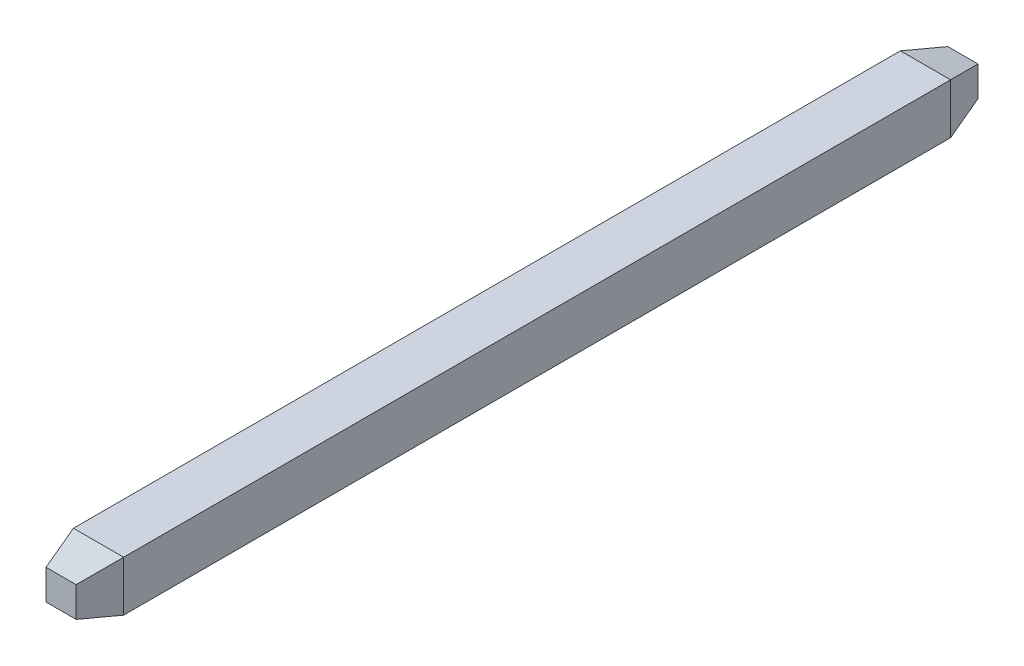
ISO-10303-21;
HEADER;
FILE_DESCRIPTION(('STEP AP214'),'2;1');
FILE_NAME('part.step','',(''),(''),'','','');
FILE_SCHEMA(('AUTOMOTIVE_DESIGN { 1 0 10303 214 1 1 1 1 }'));
ENDSEC;
DATA;
#1=APPLICATION_CONTEXT('core data for automotive mechanical design processes');
#2=APPLICATION_PROTOCOL_DEFINITION('international standard','automotive_design',2000,#1);
#3=PRODUCT_CONTEXT('',#1,'mechanical');
#4=PRODUCT('Part','Part','',(#3));
#5=PRODUCT_RELATED_PRODUCT_CATEGORY('part','',(#4));
#6=PRODUCT_DEFINITION_FORMATION('','',#4);
#7=PRODUCT_DEFINITION_CONTEXT('part definition',#1,'design');
#8=PRODUCT_DEFINITION('design','',#6,#7);
#9=PRODUCT_DEFINITION_SHAPE('','',#8);
#10=(LENGTH_UNIT() NAMED_UNIT(*) SI_UNIT(.MILLI.,.METRE.));
#11=(NAMED_UNIT(*) PLANE_ANGLE_UNIT() SI_UNIT($,.RADIAN.));
#12=(NAMED_UNIT(*) SI_UNIT($,.STERADIAN.) SOLID_ANGLE_UNIT());
#13=UNCERTAINTY_MEASURE_WITH_UNIT(LENGTH_MEASURE(1.E-05),#10,'distance_accuracy_value','');
#14=(GEOMETRIC_REPRESENTATION_CONTEXT(3) GLOBAL_UNCERTAINTY_ASSIGNED_CONTEXT((#13)) GLOBAL_UNIT_ASSIGNED_CONTEXT((#10,
#11,#12)) REPRESENTATION_CONTEXT('',''));
#15=CARTESIAN_POINT('',(0.,0.,0.));
#16=DIRECTION('',(0.,0.,1.));
#17=DIRECTION('',(1.,0.,0.));
#18=AXIS2_PLACEMENT_3D('',#15,#16,#17);
#19=CARTESIAN_POINT('',(6.08859499326237,-0.320000000000112,7.92229749663118));
#20=DIRECTION('',(0.,-0.965925826289069,0.25881904510252));
#21=DIRECTION('',(0.,-0.25881904510252,-0.965925826289069));
#22=AXIS2_PLACEMENT_3D('',#19,#20,#21);
#23=PLANE('',#22);
#24=DIRECTION('',(1.,0.,0.));
#25=VECTOR('',#24,1.);
#26=CARTESIAN_POINT('',(7.62,-0.192000000000112,8.4));
#27=LINE('',#26,#25);
#28=CARTESIAN_POINT('',(7.428,-0.192000000000111,8.4));
#29=VERTEX_POINT('',#28);
#30=CARTESIAN_POINT('',(7.812,-0.192000000000111,8.4));
#31=VERTEX_POINT('',#30);
#32=EDGE_CURVE('E20',#29,#31,#27,.T.);
#33=ORIENTED_EDGE('',*,*,#32,.F.);
#34=DIRECTION('',(0.250562807085731,0.25056280708573,0.93511312653103));
#35=VECTOR('',#34,1.);
#36=CARTESIAN_POINT('',(7.3,-0.320000000000112,7.92229749663118));
#37=LINE('',#36,#35);
#38=CARTESIAN_POINT('',(7.3,-0.320000000000112,7.92229749663118));
#39=VERTEX_POINT('',#38);
#40=EDGE_CURVE('E110',#39,#29,#37,.T.);
#41=ORIENTED_EDGE('',*,*,#40,.F.);
#42=DIRECTION('',(1.,0.,0.));
#43=VECTOR('',#42,1.);
#44=CARTESIAN_POINT('',(7.3,-0.320000000000112,7.92229749663118));
#45=LINE('',#44,#43);
#46=CARTESIAN_POINT('',(7.94,-0.320000000000111,7.92229749663118));
#47=VERTEX_POINT('',#46);
#48=EDGE_CURVE('E96',#47,#39,#45,.F.);
#49=ORIENTED_EDGE('',*,*,#48,.F.);
#50=DIRECTION('',(0.250562807085732,-0.25056280708573,-0.93511312653103));
#51=VECTOR('',#50,1.);
#52=CARTESIAN_POINT('',(7.812,-0.192000000000111,8.4));
#53=LINE('',#52,#51);
#54=EDGE_CURVE('E94',#31,#47,#53,.T.);
#55=ORIENTED_EDGE('',*,*,#54,.F.);
#56=EDGE_LOOP('',(#33,#41,#49,#55));
#57=FACE_BOUND('',#56,.T.);
#58=ADVANCED_FACE('F17',(#57),#23,.T.);
#59=CARTESIAN_POINT('',(6.08859499326237,-0.320000000000112,-2.62229749663118));
#60=DIRECTION('',(0.,0.965925826289068,0.258819045102521));
#61=DIRECTION('',(0.,-0.258819045102521,0.965925826289068));
#62=AXIS2_PLACEMENT_3D('',#59,#60,#61);
#63=PLANE('',#62);
#64=DIRECTION('',(0.250562807085733,0.25056280708573,-0.93511312653103));
#65=VECTOR('',#64,1.);
#66=CARTESIAN_POINT('',(7.3,-0.320000000000112,-2.62229749663118));
#67=LINE('',#66,#65);
#68=CARTESIAN_POINT('',(7.3,-0.320000000000112,-2.62229749663118));
#69=VERTEX_POINT('',#68);
#70=CARTESIAN_POINT('',(7.428,-0.192000000000111,-3.1));
#71=VERTEX_POINT('',#70);
#72=EDGE_CURVE('E113',#69,#71,#67,.T.);
#73=ORIENTED_EDGE('',*,*,#72,.T.);
#74=DIRECTION('',(1.,0.,0.));
#75=VECTOR('',#74,1.);
#76=CARTESIAN_POINT('',(7.62,-0.192000000000112,-3.1));
#77=LINE('',#76,#75);
#78=CARTESIAN_POINT('',(7.812,-0.192000000000111,-3.1));
#79=VERTEX_POINT('',#78);
#80=EDGE_CURVE('E79',#71,#79,#77,.T.);
#81=ORIENTED_EDGE('',*,*,#80,.T.);
#82=DIRECTION('',(0.250562807085734,-0.25056280708573,0.935113126531029));
#83=VECTOR('',#82,1.);
#84=CARTESIAN_POINT('',(7.812,-0.192000000000111,-3.1));
#85=LINE('',#84,#83);
#86=CARTESIAN_POINT('',(7.94,-0.320000000000111,-2.62229749663118));
#87=VERTEX_POINT('',#86);
#88=EDGE_CURVE('E108',#79,#87,#85,.T.);
#89=ORIENTED_EDGE('',*,*,#88,.T.);
#90=DIRECTION('',(1.,0.,0.));
#91=VECTOR('',#90,1.);
#92=CARTESIAN_POINT('',(7.3,-0.320000000000112,-2.62229749663118));
#93=LINE('',#92,#91);
#94=EDGE_CURVE('E118',#69,#87,#93,.T.);
#95=ORIENTED_EDGE('',*,*,#94,.F.);
#96=EDGE_LOOP('',(#73,#81,#89,#95));
#97=FACE_BOUND('',#96,.T.);
#98=ADVANCED_FACE('F281',(#97),#63,.F.);
#99=CARTESIAN_POINT('',(7.62,-1.12044153219634E-13,8.4));
#100=DIRECTION('',(0.,0.,1.));
#101=DIRECTION('',(1.,0.,0.));
#102=AXIS2_PLACEMENT_3D('',#99,#100,#101);
#103=PLANE('',#102);
#104=ORIENTED_EDGE('',*,*,#32,.T.);
#105=DIRECTION('',(0.,1.,0.));
#106=VECTOR('',#105,1.);
#107=CARTESIAN_POINT('',(7.812,-1.53140500673774,8.4));
#108=LINE('',#107,#106);
#109=CARTESIAN_POINT('',(7.812,0.191999999999889,8.4));
#110=VERTEX_POINT('',#109);
#111=EDGE_CURVE('E88',#110,#31,#108,.F.);
#112=ORIENTED_EDGE('',*,*,#111,.F.);
#113=DIRECTION('',(1.,0.,0.));
#114=VECTOR('',#113,1.);
#115=CARTESIAN_POINT('',(9.15140500673763,0.191999999999887,8.4));
#116=LINE('',#115,#114);
#117=CARTESIAN_POINT('',(7.428,0.191999999999888,8.4));
#118=VERTEX_POINT('',#117);
#119=EDGE_CURVE('E124',#118,#110,#116,.T.);
#120=ORIENTED_EDGE('',*,*,#119,.F.);
#121=DIRECTION('',(0.,1.,0.));
#122=VECTOR('',#121,1.);
#123=CARTESIAN_POINT('',(7.428,1.53140500673752,8.4));
#124=LINE('',#123,#122);
#125=EDGE_CURVE('E90',#29,#118,#124,.T.);
#126=ORIENTED_EDGE('',*,*,#125,.F.);
#127=EDGE_LOOP('',(#104,#112,#120,#126));
#128=FACE_BOUND('',#127,.T.);
#129=ADVANCED_FACE('F85',(#128),#103,.T.);
#130=CARTESIAN_POINT('',(7.94,-1.53140500673774,7.92229749663118));
#131=DIRECTION('',(0.965925826289069,0.,0.25881904510252));
#132=DIRECTION('',(0.25881904510252,0.,-0.965925826289069));
#133=AXIS2_PLACEMENT_3D('',#130,#131,#132);
#134=PLANE('',#133);
#135=ORIENTED_EDGE('',*,*,#111,.T.);
#136=ORIENTED_EDGE('',*,*,#54,.T.);
#137=DIRECTION('',(0.,1.,0.));
#138=VECTOR('',#137,1.);
#139=CARTESIAN_POINT('',(7.94,-0.320000000000111,7.92229749663118));
#140=LINE('',#139,#138);
#141=CARTESIAN_POINT('',(7.94,0.319999999999888,7.92229749663118));
#142=VERTEX_POINT('',#141);
#143=EDGE_CURVE('E127',#142,#47,#140,.F.);
#144=ORIENTED_EDGE('',*,*,#143,.F.);
#145=DIRECTION('',(0.25056280708573,0.250562807085731,-0.93511312653103));
#146=VECTOR('',#145,1.);
#147=CARTESIAN_POINT('',(7.812,0.191999999999888,8.4));
#148=LINE('',#147,#146);
#149=EDGE_CURVE('E102',#110,#142,#148,.T.);
#150=ORIENTED_EDGE('',*,*,#149,.F.);
#151=EDGE_LOOP('',(#135,#136,#144,#150));
#152=FACE_BOUND('',#151,.T.);
#153=ADVANCED_FACE('F100',(#152),#134,.T.);
#154=CARTESIAN_POINT('',(7.62,-1.12044153219634E-13,-3.1));
#155=DIRECTION('',(0.,0.,1.));
#156=DIRECTION('',(1.,0.,0.));
#157=AXIS2_PLACEMENT_3D('',#154,#155,#156);
#158=PLANE('',#157);
#159=DIRECTION('',(0.,1.,0.));
#160=VECTOR('',#159,1.);
#161=CARTESIAN_POINT('',(7.812,-1.53140500673774,-3.1));
#162=LINE('',#161,#160);
#163=CARTESIAN_POINT('',(7.812,0.191999999999889,-3.1));
#164=VERTEX_POINT('',#163);
#165=EDGE_CURVE('E106',#164,#79,#162,.F.);
#166=ORIENTED_EDGE('',*,*,#165,.T.);
#167=ORIENTED_EDGE('',*,*,#80,.F.);
#168=DIRECTION('',(0.,1.,0.));
#169=VECTOR('',#168,1.);
#170=CARTESIAN_POINT('',(7.428,1.53140500673752,-3.1));
#171=LINE('',#170,#169);
#172=CARTESIAN_POINT('',(7.428,0.191999999999888,-3.1));
#173=VERTEX_POINT('',#172);
#174=EDGE_CURVE('E115',#71,#173,#171,.T.);
#175=ORIENTED_EDGE('',*,*,#174,.T.);
#176=DIRECTION('',(1.,0.,0.));
#177=VECTOR('',#176,1.);
#178=CARTESIAN_POINT('',(9.15140500673763,0.191999999999887,-3.1));
#179=LINE('',#178,#177);
#180=EDGE_CURVE('E138',#173,#164,#179,.T.);
#181=ORIENTED_EDGE('',*,*,#180,.T.);
#182=EDGE_LOOP('',(#166,#167,#175,#181));
#183=FACE_BOUND('',#182,.T.);
#184=ADVANCED_FACE('F257',(#183),#158,.F.);
#185=CARTESIAN_POINT('',(7.94,-1.53140500673774,-2.62229749663118));
#186=DIRECTION('',(-0.965925826289068,0.,0.258819045102521));
#187=DIRECTION('',(0.258819045102521,0.,0.965925826289068));
#188=AXIS2_PLACEMENT_3D('',#185,#186,#187);
#189=PLANE('',#188);
#190=ORIENTED_EDGE('',*,*,#88,.F.);
#191=ORIENTED_EDGE('',*,*,#165,.F.);
#192=DIRECTION('',(0.250562807085731,0.250562807085732,0.935113126531029));
#193=VECTOR('',#192,1.);
#194=CARTESIAN_POINT('',(7.812,0.191999999999887,-3.1));
#195=LINE('',#194,#193);
#196=CARTESIAN_POINT('',(7.94,0.319999999999888,-2.62229749663118));
#197=VERTEX_POINT('',#196);
#198=EDGE_CURVE('E140',#164,#197,#195,.T.);
#199=ORIENTED_EDGE('',*,*,#198,.T.);
#200=DIRECTION('',(0.,1.,0.));
#201=VECTOR('',#200,1.);
#202=CARTESIAN_POINT('',(7.94,-0.320000000000111,-2.62229749663118));
#203=LINE('',#202,#201);
#204=EDGE_CURVE('E133',#87,#197,#203,.T.);
#205=ORIENTED_EDGE('',*,*,#204,.F.);
#206=EDGE_LOOP('',(#190,#191,#199,#205));
#207=FACE_BOUND('',#206,.T.);
#208=ADVANCED_FACE('F249',(#207),#189,.F.);
#209=CARTESIAN_POINT('',(7.3,1.53140500673752,7.92229749663118));
#210=DIRECTION('',(-0.965925826289069,0.,0.25881904510252));
#211=DIRECTION('',(0.25881904510252,0.,0.965925826289069));
#212=AXIS2_PLACEMENT_3D('',#209,#210,#211);
#213=PLANE('',#212);
#214=ORIENTED_EDGE('',*,*,#125,.T.);
#215=DIRECTION('',(0.250562807085729,-0.250562807085731,0.93511312653103));
#216=VECTOR('',#215,1.);
#217=CARTESIAN_POINT('',(7.3,0.319999999999889,7.92229749663118));
#218=LINE('',#217,#216);
#219=CARTESIAN_POINT('',(7.3,0.319999999999888,7.92229749663118));
#220=VERTEX_POINT('',#219);
#221=EDGE_CURVE('E121',#220,#118,#218,.T.);
#222=ORIENTED_EDGE('',*,*,#221,.F.);
#223=DIRECTION('',(0.,-1.,0.));
#224=VECTOR('',#223,1.);
#225=CARTESIAN_POINT('',(7.3,0.319999999999889,7.92229749663118));
#226=LINE('',#225,#224);
#227=EDGE_CURVE('E142',#39,#220,#226,.F.);
#228=ORIENTED_EDGE('',*,*,#227,.F.);
#229=ORIENTED_EDGE('',*,*,#40,.T.);
#230=EDGE_LOOP('',(#214,#222,#228,#229));
#231=FACE_BOUND('',#230,.T.);
#232=ADVANCED_FACE('F171',(#231),#213,.T.);
#233=CARTESIAN_POINT('',(7.3,1.53140500673752,-2.62229749663118));
#234=DIRECTION('',(0.965925826289068,0.,0.258819045102521));
#235=DIRECTION('',(0.258819045102521,0.,-0.965925826289068));
#236=AXIS2_PLACEMENT_3D('',#233,#234,#235);
#237=PLANE('',#236);
#238=DIRECTION('',(0.250562807085729,-0.250562807085732,-0.93511312653103));
#239=VECTOR('',#238,1.);
#240=CARTESIAN_POINT('',(7.3,0.319999999999889,-2.62229749663118));
#241=LINE('',#240,#239);
#242=CARTESIAN_POINT('',(7.3,0.319999999999889,-2.62229749663118));
#243=VERTEX_POINT('',#242);
#244=EDGE_CURVE('E136',#243,#173,#241,.T.);
#245=ORIENTED_EDGE('',*,*,#244,.T.);
#246=ORIENTED_EDGE('',*,*,#174,.F.);
#247=ORIENTED_EDGE('',*,*,#72,.F.);
#248=DIRECTION('',(0.,-1.,0.));
#249=VECTOR('',#248,1.);
#250=CARTESIAN_POINT('',(7.3,0.319999999999889,-2.62229749663118));
#251=LINE('',#250,#249);
#252=EDGE_CURVE('E35',#243,#69,#251,.T.);
#253=ORIENTED_EDGE('',*,*,#252,.F.);
#254=EDGE_LOOP('',(#245,#246,#247,#253));
#255=FACE_BOUND('',#254,.T.);
#256=ADVANCED_FACE('F188',(#255),#237,.F.);
#257=CARTESIAN_POINT('',(7.3,-0.320000000000112,-3.1));
#258=DIRECTION('',(0.,-1.,0.));
#259=DIRECTION('',(1.,0.,0.));
#260=AXIS2_PLACEMENT_3D('',#257,#258,#259);
#261=PLANE('',#260);
#262=ORIENTED_EDGE('',*,*,#94,.T.);
#263=DIRECTION('',(0.,0.,1.));
#264=VECTOR('',#263,1.);
#265=CARTESIAN_POINT('',(7.94,-0.320000000000111,-3.1));
#266=LINE('',#265,#264);
#267=EDGE_CURVE('E130',#47,#87,#266,.F.);
#268=ORIENTED_EDGE('',*,*,#267,.F.);
#269=ORIENTED_EDGE('',*,*,#48,.T.);
#270=DIRECTION('',(0.,0.,1.));
#271=VECTOR('',#270,1.);
#272=CARTESIAN_POINT('',(7.3,-0.320000000000112,-3.1));
#273=LINE('',#272,#271);
#274=EDGE_CURVE('E146',#69,#39,#273,.T.);
#275=ORIENTED_EDGE('',*,*,#274,.F.);
#276=EDGE_LOOP('',(#262,#268,#269,#275));
#277=FACE_BOUND('',#276,.T.);
#278=ADVANCED_FACE('F174',(#277),#261,.T.);
#279=CARTESIAN_POINT('',(9.15140500673763,0.319999999999888,7.92229749663118));
#280=DIRECTION('',(0.,0.965925826289069,0.25881904510252));
#281=DIRECTION('',(0.,-0.25881904510252,0.965925826289069));
#282=AXIS2_PLACEMENT_3D('',#279,#280,#281);
#283=PLANE('',#282);
#284=ORIENTED_EDGE('',*,*,#119,.T.);
#285=ORIENTED_EDGE('',*,*,#149,.T.);
#286=DIRECTION('',(-1.,0.,0.));
#287=VECTOR('',#286,1.);
#288=CARTESIAN_POINT('',(7.94,0.319999999999888,7.92229749663118));
#289=LINE('',#288,#287);
#290=EDGE_CURVE('E149',#220,#142,#289,.F.);
#291=ORIENTED_EDGE('',*,*,#290,.F.);
#292=ORIENTED_EDGE('',*,*,#221,.T.);
#293=EDGE_LOOP('',(#284,#285,#291,#292));
#294=FACE_BOUND('',#293,.T.);
#295=ADVANCED_FACE('F179',(#294),#283,.T.);
#296=CARTESIAN_POINT('',(7.94,-0.320000000000111,-3.1));
#297=DIRECTION('',(1.,0.,0.));
#298=DIRECTION('',(0.,1.,0.));
#299=AXIS2_PLACEMENT_3D('',#296,#297,#298);
#300=PLANE('',#299);
#301=ORIENTED_EDGE('',*,*,#204,.T.);
#302=DIRECTION('',(0.,0.,1.));
#303=VECTOR('',#302,1.);
#304=CARTESIAN_POINT('',(7.94,0.319999999999888,-3.1));
#305=LINE('',#304,#303);
#306=EDGE_CURVE('E152',#142,#197,#305,.F.);
#307=ORIENTED_EDGE('',*,*,#306,.F.);
#308=ORIENTED_EDGE('',*,*,#143,.T.);
#309=ORIENTED_EDGE('',*,*,#267,.T.);
#310=EDGE_LOOP('',(#301,#307,#308,#309));
#311=FACE_BOUND('',#310,.T.);
#312=ADVANCED_FACE('F177',(#311),#300,.T.);
#313=CARTESIAN_POINT('',(9.15140500673763,0.319999999999888,-2.62229749663118));
#314=DIRECTION('',(0.,-0.965925826289068,0.258819045102521));
#315=DIRECTION('',(0.,-0.258819045102521,-0.965925826289068));
#316=AXIS2_PLACEMENT_3D('',#313,#314,#315);
#317=PLANE('',#316);
#318=ORIENTED_EDGE('',*,*,#198,.F.);
#319=ORIENTED_EDGE('',*,*,#180,.F.);
#320=ORIENTED_EDGE('',*,*,#244,.F.);
#321=DIRECTION('',(-1.,0.,0.));
#322=VECTOR('',#321,1.);
#323=CARTESIAN_POINT('',(7.94,0.319999999999888,-2.62229749663118));
#324=LINE('',#323,#322);
#325=EDGE_CURVE('E26',#197,#243,#324,.T.);
#326=ORIENTED_EDGE('',*,*,#325,.F.);
#327=EDGE_LOOP('',(#318,#319,#320,#326));
#328=FACE_BOUND('',#327,.T.);
#329=ADVANCED_FACE('F163',(#328),#317,.F.);
#330=CARTESIAN_POINT('',(7.3,0.319999999999889,-3.1));
#331=DIRECTION('',(-1.,0.,0.));
#332=DIRECTION('',(0.,-1.,0.));
#333=AXIS2_PLACEMENT_3D('',#330,#331,#332);
#334=PLANE('',#333);
#335=ORIENTED_EDGE('',*,*,#252,.T.);
#336=ORIENTED_EDGE('',*,*,#274,.T.);
#337=ORIENTED_EDGE('',*,*,#227,.T.);
#338=DIRECTION('',(0.,0.,1.));
#339=VECTOR('',#338,1.);
#340=CARTESIAN_POINT('',(7.3,0.319999999999888,-3.1));
#341=LINE('',#340,#339);
#342=EDGE_CURVE('E11',#243,#220,#341,.T.);
#343=ORIENTED_EDGE('',*,*,#342,.F.);
#344=EDGE_LOOP('',(#335,#336,#337,#343));
#345=FACE_BOUND('',#344,.T.);
#346=ADVANCED_FACE('F167',(#345),#334,.T.);
#347=CARTESIAN_POINT('',(7.94,0.319999999999888,-3.1));
#348=DIRECTION('',(0.,1.,0.));
#349=DIRECTION('',(-1.,0.,0.));
#350=AXIS2_PLACEMENT_3D('',#347,#348,#349);
#351=PLANE('',#350);
#352=ORIENTED_EDGE('',*,*,#325,.T.);
#353=ORIENTED_EDGE('',*,*,#342,.T.);
#354=ORIENTED_EDGE('',*,*,#290,.T.);
#355=ORIENTED_EDGE('',*,*,#306,.T.);
#356=EDGE_LOOP('',(#352,#353,#354,#355));
#357=FACE_BOUND('',#356,.T.);
#358=ADVANCED_FACE('F158',(#357),#351,.T.);
#359=CLOSED_SHELL('',(#58,#98,#129,#153,#184,#208,#232,#256,#278,#295,#312,#329,#346,#358));
#360=MANIFOLD_SOLID_BREP('B1',#359);
#361=ADVANCED_BREP_SHAPE_REPRESENTATION('',(#18,#360),#14);
#362=SHAPE_DEFINITION_REPRESENTATION(#9,#361);
ENDSEC;
END-ISO-10303-21;
